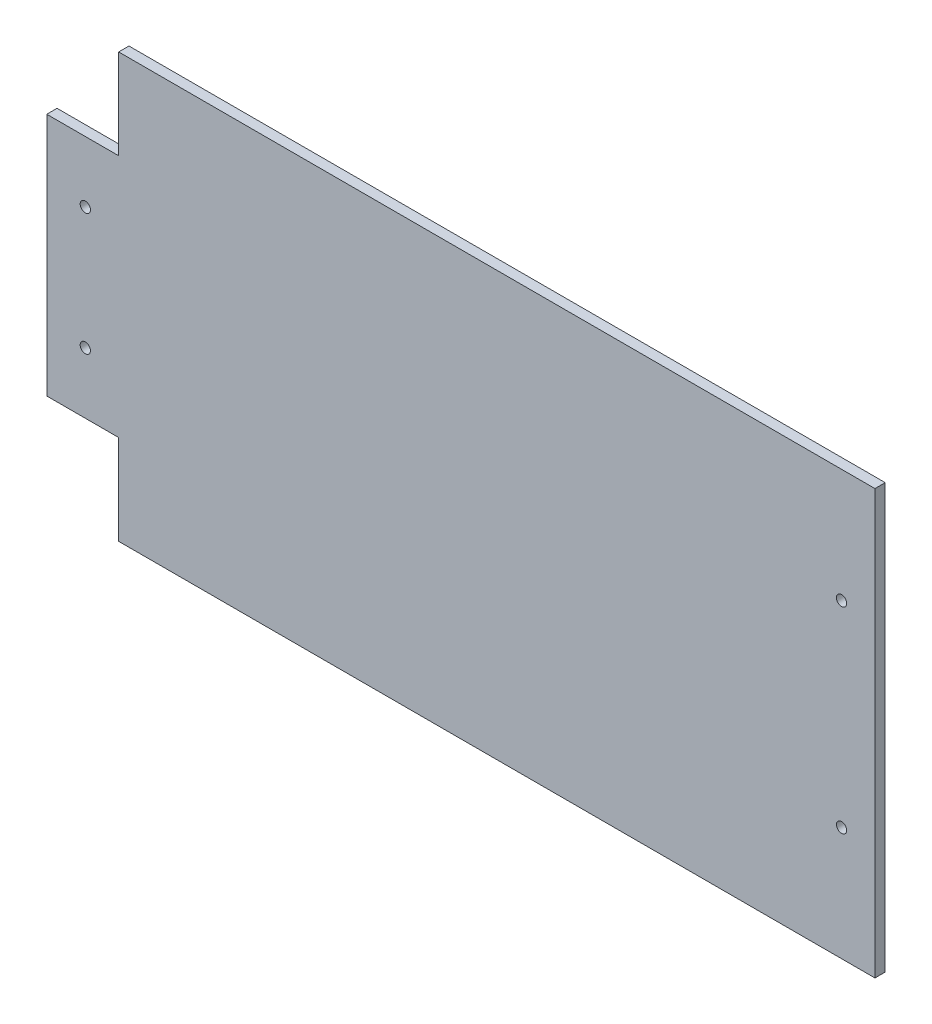
ISO-10303-21;
HEADER;
FILE_DESCRIPTION(('STEP AP214'),'2;1');
FILE_NAME('part.step','',(''),(''),'','','');
FILE_SCHEMA(('AUTOMOTIVE_DESIGN { 1 0 10303 214 1 1 1 1 }'));
ENDSEC;
DATA;
#1=APPLICATION_CONTEXT('core data for automotive mechanical design processes');
#2=APPLICATION_PROTOCOL_DEFINITION('international standard','automotive_design',2000,#1);
#3=PRODUCT_CONTEXT('',#1,'mechanical');
#4=PRODUCT('Part','Part','',(#3));
#5=PRODUCT_RELATED_PRODUCT_CATEGORY('part','',(#4));
#6=PRODUCT_DEFINITION_FORMATION('','',#4);
#7=PRODUCT_DEFINITION_CONTEXT('part definition',#1,'design');
#8=PRODUCT_DEFINITION('design','',#6,#7);
#9=PRODUCT_DEFINITION_SHAPE('','',#8);
#10=(LENGTH_UNIT() NAMED_UNIT(*) SI_UNIT(.MILLI.,.METRE.));
#11=(NAMED_UNIT(*) PLANE_ANGLE_UNIT() SI_UNIT($,.RADIAN.));
#12=(NAMED_UNIT(*) SI_UNIT($,.STERADIAN.) SOLID_ANGLE_UNIT());
#13=UNCERTAINTY_MEASURE_WITH_UNIT(LENGTH_MEASURE(1.E-05),#10,'distance_accuracy_value','');
#14=(GEOMETRIC_REPRESENTATION_CONTEXT(3) GLOBAL_UNCERTAINTY_ASSIGNED_CONTEXT((#13)) GLOBAL_UNIT_ASSIGNED_CONTEXT((#10,
#11,#12)) REPRESENTATION_CONTEXT('',''));
#15=CARTESIAN_POINT('',(0.,0.,0.));
#16=DIRECTION('',(0.,0.,1.));
#17=DIRECTION('',(1.,0.,0.));
#18=AXIS2_PLACEMENT_3D('',#15,#16,#17);
#19=CARTESIAN_POINT('',(0.,0.,4.));
#20=DIRECTION('',(0.,0.,-1.));
#21=DIRECTION('',(-1.,0.,0.));
#22=AXIS2_PLACEMENT_3D('',#19,#20,#21);
#23=PLANE('',#22);
#24=DIRECTION('',(0.,-1.,0.));
#25=VECTOR('',#24,1.);
#26=CARTESIAN_POINT('',(-196.100746736514,-36.390474580789,4.));
#27=LINE('',#26,#25);
#28=CARTESIAN_POINT('',(-196.100746736514,58.6095254381771,4.));
#29=VERTEX_POINT('',#28);
#30=CARTESIAN_POINT('',(-196.100746736514,-36.390474580789,4.));
#31=VERTEX_POINT('',#30);
#32=EDGE_CURVE('E170',#29,#31,#27,.T.);
#33=ORIENTED_EDGE('',*,*,#32,.T.);
#34=DIRECTION('',(1.,0.,0.));
#35=VECTOR('',#34,1.);
#36=CARTESIAN_POINT('',(-168.100746737764,-36.390474580789,4.));
#37=LINE('',#36,#35);
#38=CARTESIAN_POINT('',(-168.100746737764,-36.390474580789,4.));
#39=VERTEX_POINT('',#38);
#40=EDGE_CURVE('E106',#31,#39,#37,.T.);
#41=ORIENTED_EDGE('',*,*,#40,.T.);
#42=DIRECTION('',(0.,-1.,0.));
#43=VECTOR('',#42,1.);
#44=CARTESIAN_POINT('',(-168.100746737764,-71.3904746283267,4.));
#45=LINE('',#44,#43);
#46=CARTESIAN_POINT('',(-168.100746737764,-71.3904746283267,4.));
#47=VERTEX_POINT('',#46);
#48=EDGE_CURVE('E191',#39,#47,#45,.T.);
#49=ORIENTED_EDGE('',*,*,#48,.T.);
#50=DIRECTION('',(1.,0.,0.));
#51=VECTOR('',#50,1.);
#52=CARTESIAN_POINT('',(126.299253277226,-71.3904746283267,4.));
#53=LINE('',#52,#51);
#54=CARTESIAN_POINT('',(126.299253277226,-71.3904746283267,4.));
#55=VERTEX_POINT('',#54);
#56=EDGE_CURVE('E205',#47,#55,#53,.T.);
#57=ORIENTED_EDGE('',*,*,#56,.T.);
#58=DIRECTION('',(0.,1.,0.));
#59=VECTOR('',#58,1.);
#60=CARTESIAN_POINT('',(126.299253277226,93.6095256103751,4.));
#61=LINE('',#60,#59);
#62=CARTESIAN_POINT('',(126.299253277226,93.6095256103751,4.));
#63=VERTEX_POINT('',#62);
#64=EDGE_CURVE('E125',#55,#63,#61,.T.);
#65=ORIENTED_EDGE('',*,*,#64,.T.);
#66=DIRECTION('',(-1.,0.,0.));
#67=VECTOR('',#66,1.);
#68=CARTESIAN_POINT('',(-168.100746718209,93.6095256103751,4.));
#69=LINE('',#68,#67);
#70=CARTESIAN_POINT('',(-168.100746718209,93.6095256103751,4.));
#71=VERTEX_POINT('',#70);
#72=EDGE_CURVE('E119',#63,#71,#69,.T.);
#73=ORIENTED_EDGE('',*,*,#72,.T.);
#74=DIRECTION('',(0.,-1.,0.));
#75=VECTOR('',#74,1.);
#76=CARTESIAN_POINT('',(-168.100746718209,58.6095254381771,4.));
#77=LINE('',#76,#75);
#78=CARTESIAN_POINT('',(-168.100746718209,58.6095254381771,4.));
#79=VERTEX_POINT('',#78);
#80=EDGE_CURVE('E123',#71,#79,#77,.T.);
#81=ORIENTED_EDGE('',*,*,#80,.T.);
#82=DIRECTION('',(-1.,0.,0.));
#83=VECTOR('',#82,1.);
#84=CARTESIAN_POINT('',(-196.100746736514,58.6095254381771,4.));
#85=LINE('',#84,#83);
#86=EDGE_CURVE('E63',#79,#29,#85,.T.);
#87=ORIENTED_EDGE('',*,*,#86,.T.);
#88=EDGE_LOOP('',(#33,#41,#49,#57,#65,#73,#81,#87));
#89=FACE_BOUND('',#88,.T.);
#90=CARTESIAN_POINT('',(-181.100722248535,-12.6404744968072,4.));
#91=DIRECTION('',(0.,0.,1.));
#92=DIRECTION('',(1.,0.,0.));
#93=AXIS2_PLACEMENT_3D('',#90,#91,#92);
#94=CIRCLE('',#93,2.0000000000001);
#95=CARTESIAN_POINT('',(-179.100722248534,-12.6404744968072,4.));
#96=VERTEX_POINT('',#95);
#97=EDGE_CURVE('E152',#96,#96,#94,.T.);
#98=ORIENTED_EDGE('',*,*,#97,.F.);
#99=EDGE_LOOP('',(#98));
#100=FACE_BOUND('',#99,.T.);
#101=CARTESIAN_POINT('',(-181.100722248653,34.8595254567217,4.));
#102=DIRECTION('',(0.,0.,1.));
#103=DIRECTION('',(1.,0.,0.));
#104=AXIS2_PLACEMENT_3D('',#101,#102,#103);
#105=CIRCLE('',#104,2.0000000000001);
#106=CARTESIAN_POINT('',(-179.100722248653,34.8595254567217,4.));
#107=VERTEX_POINT('',#106);
#108=EDGE_CURVE('E219',#107,#107,#105,.T.);
#109=ORIENTED_EDGE('',*,*,#108,.F.);
#110=EDGE_LOOP('',(#109));
#111=FACE_BOUND('',#110,.T.);
#112=CARTESIAN_POINT('',(113.299277705841,49.3595254849248,4.));
#113=DIRECTION('',(0.,0.,1.));
#114=DIRECTION('',(1.,0.,0.));
#115=AXIS2_PLACEMENT_3D('',#112,#113,#114);
#116=CIRCLE('',#115,2.0000000000001);
#117=CARTESIAN_POINT('',(115.299277705841,49.3595254849248,4.));
#118=VERTEX_POINT('',#117);
#119=EDGE_CURVE('E227',#118,#118,#116,.T.);
#120=ORIENTED_EDGE('',*,*,#119,.F.);
#121=EDGE_LOOP('',(#120));
#122=FACE_BOUND('',#121,.T.);
#123=CARTESIAN_POINT('',(113.299277700855,-27.1404745152088,4.));
#124=DIRECTION('',(0.,0.,1.));
#125=DIRECTION('',(1.,0.,0.));
#126=AXIS2_PLACEMENT_3D('',#123,#124,#125);
#127=CIRCLE('',#126,2.0000000000001);
#128=CARTESIAN_POINT('',(115.299277700855,-27.1404745152088,4.));
#129=VERTEX_POINT('',#128);
#130=EDGE_CURVE('E235',#129,#129,#127,.T.);
#131=ORIENTED_EDGE('',*,*,#130,.F.);
#132=EDGE_LOOP('',(#131));
#133=FACE_BOUND('',#132,.T.);
#134=ADVANCED_FACE('F45',(#89,#100,#111,#122,#133),#23,.F.);
#135=CARTESIAN_POINT('',(0.,0.,0.));
#136=DIRECTION('',(0.,0.,-1.));
#137=DIRECTION('',(-1.,0.,0.));
#138=AXIS2_PLACEMENT_3D('',#135,#136,#137);
#139=PLANE('',#138);
#140=CARTESIAN_POINT('',(113.299277705841,49.3595254849248,0.));
#141=DIRECTION('',(0.,0.,1.));
#142=DIRECTION('',(1.,0.,0.));
#143=AXIS2_PLACEMENT_3D('',#140,#141,#142);
#144=CIRCLE('',#143,2.0000000000001);
#145=CARTESIAN_POINT('',(115.299277705841,49.3595254849248,0.));
#146=VERTEX_POINT('',#145);
#147=EDGE_CURVE('E231',#146,#146,#144,.T.);
#148=ORIENTED_EDGE('',*,*,#147,.T.);
#149=EDGE_LOOP('',(#148));
#150=FACE_BOUND('',#149,.T.);
#151=CARTESIAN_POINT('',(-181.100722248535,-12.6404744968072,0.));
#152=DIRECTION('',(0.,0.,1.));
#153=DIRECTION('',(1.,0.,0.));
#154=AXIS2_PLACEMENT_3D('',#151,#152,#153);
#155=CIRCLE('',#154,2.0000000000001);
#156=CARTESIAN_POINT('',(-179.100722248534,-12.6404744968072,0.));
#157=VERTEX_POINT('',#156);
#158=EDGE_CURVE('E215',#157,#157,#155,.T.);
#159=ORIENTED_EDGE('',*,*,#158,.T.);
#160=EDGE_LOOP('',(#159));
#161=FACE_BOUND('',#160,.T.);
#162=DIRECTION('',(0.,-1.,0.));
#163=VECTOR('',#162,1.);
#164=CARTESIAN_POINT('',(-196.100746736514,-36.390474580789,0.));
#165=LINE('',#164,#163);
#166=CARTESIAN_POINT('',(-196.100746736514,58.6095254381771,0.));
#167=VERTEX_POINT('',#166);
#168=CARTESIAN_POINT('',(-196.100746736514,-36.390474580789,0.));
#169=VERTEX_POINT('',#168);
#170=EDGE_CURVE('E147',#167,#169,#165,.T.);
#171=ORIENTED_EDGE('',*,*,#170,.F.);
#172=DIRECTION('',(-1.,0.,0.));
#173=VECTOR('',#172,1.);
#174=CARTESIAN_POINT('',(-196.100746736514,58.6095254381771,0.));
#175=LINE('',#174,#173);
#176=CARTESIAN_POINT('',(-168.100746718209,58.6095254381771,0.));
#177=VERTEX_POINT('',#176);
#178=EDGE_CURVE('E98',#177,#167,#175,.T.);
#179=ORIENTED_EDGE('',*,*,#178,.F.);
#180=DIRECTION('',(0.,-1.,0.));
#181=VECTOR('',#180,1.);
#182=CARTESIAN_POINT('',(-168.100746718209,58.6095254381771,0.));
#183=LINE('',#182,#181);
#184=CARTESIAN_POINT('',(-168.100746718209,93.6095256103751,0.));
#185=VERTEX_POINT('',#184);
#186=EDGE_CURVE('E92',#185,#177,#183,.T.);
#187=ORIENTED_EDGE('',*,*,#186,.F.);
#188=DIRECTION('',(-1.,0.,0.));
#189=VECTOR('',#188,1.);
#190=CARTESIAN_POINT('',(-168.100746718209,93.6095256103751,0.));
#191=LINE('',#190,#189);
#192=CARTESIAN_POINT('',(126.299253277226,93.6095256103751,0.));
#193=VERTEX_POINT('',#192);
#194=EDGE_CURVE('E134',#193,#185,#191,.T.);
#195=ORIENTED_EDGE('',*,*,#194,.F.);
#196=DIRECTION('',(0.,1.,0.));
#197=VECTOR('',#196,1.);
#198=CARTESIAN_POINT('',(126.299253277226,93.6095256103751,0.));
#199=LINE('',#198,#197);
#200=CARTESIAN_POINT('',(126.299253277226,-71.3904746283267,0.));
#201=VERTEX_POINT('',#200);
#202=EDGE_CURVE('E161',#201,#193,#199,.T.);
#203=ORIENTED_EDGE('',*,*,#202,.F.);
#204=DIRECTION('',(1.,0.,0.));
#205=VECTOR('',#204,1.);
#206=CARTESIAN_POINT('',(126.299253277226,-71.3904746283267,0.));
#207=LINE('',#206,#205);
#208=CARTESIAN_POINT('',(-168.100746737764,-71.3904746283267,0.));
#209=VERTEX_POINT('',#208);
#210=EDGE_CURVE('E158',#209,#201,#207,.T.);
#211=ORIENTED_EDGE('',*,*,#210,.F.);
#212=DIRECTION('',(0.,-1.,0.));
#213=VECTOR('',#212,1.);
#214=CARTESIAN_POINT('',(-168.100746737764,-71.3904746283267,0.));
#215=LINE('',#214,#213);
#216=CARTESIAN_POINT('',(-168.100746737764,-36.390474580789,0.));
#217=VERTEX_POINT('',#216);
#218=EDGE_CURVE('E155',#217,#209,#215,.T.);
#219=ORIENTED_EDGE('',*,*,#218,.F.);
#220=DIRECTION('',(1.,0.,0.));
#221=VECTOR('',#220,1.);
#222=CARTESIAN_POINT('',(-168.100746737764,-36.390474580789,0.));
#223=LINE('',#222,#221);
#224=EDGE_CURVE('E151',#169,#217,#223,.T.);
#225=ORIENTED_EDGE('',*,*,#224,.F.);
#226=EDGE_LOOP('',(#171,#179,#187,#195,#203,#211,#219,#225));
#227=FACE_BOUND('',#226,.T.);
#228=CARTESIAN_POINT('',(-181.100722248653,34.8595254567217,0.));
#229=DIRECTION('',(0.,0.,1.));
#230=DIRECTION('',(1.,0.,0.));
#231=AXIS2_PLACEMENT_3D('',#228,#229,#230);
#232=CIRCLE('',#231,2.0000000000001);
#233=CARTESIAN_POINT('',(-179.100722248653,34.8595254567217,0.));
#234=VERTEX_POINT('',#233);
#235=EDGE_CURVE('E223',#234,#234,#232,.T.);
#236=ORIENTED_EDGE('',*,*,#235,.T.);
#237=EDGE_LOOP('',(#236));
#238=FACE_BOUND('',#237,.T.);
#239=CARTESIAN_POINT('',(113.299277700855,-27.1404745152088,0.));
#240=DIRECTION('',(0.,0.,1.));
#241=DIRECTION('',(1.,0.,0.));
#242=AXIS2_PLACEMENT_3D('',#239,#240,#241);
#243=CIRCLE('',#242,2.0000000000001);
#244=CARTESIAN_POINT('',(115.299277700855,-27.1404745152088,0.));
#245=VERTEX_POINT('',#244);
#246=EDGE_CURVE('E239',#245,#245,#243,.T.);
#247=ORIENTED_EDGE('',*,*,#246,.T.);
#248=EDGE_LOOP('',(#247));
#249=FACE_BOUND('',#248,.T.);
#250=ADVANCED_FACE('F195',(#150,#161,#227,#238,#249),#139,.T.);
#251=CARTESIAN_POINT('',(-196.100746736514,-36.390474580789,4.));
#252=DIRECTION('',(1.,0.,0.));
#253=DIRECTION('',(0.,0.,-1.));
#254=AXIS2_PLACEMENT_3D('',#251,#252,#253);
#255=PLANE('',#254);
#256=ORIENTED_EDGE('',*,*,#170,.T.);
#257=DIRECTION('',(0.,0.,-1.));
#258=VECTOR('',#257,1.);
#259=CARTESIAN_POINT('',(-196.100746736514,-36.390474580789,4.));
#260=LINE('',#259,#258);
#261=EDGE_CURVE('E11',#31,#169,#260,.T.);
#262=ORIENTED_EDGE('',*,*,#261,.F.);
#263=ORIENTED_EDGE('',*,*,#32,.F.);
#264=DIRECTION('',(0.,0.,-1.));
#265=VECTOR('',#264,1.);
#266=CARTESIAN_POINT('',(-196.100746736514,58.6095254381771,4.));
#267=LINE('',#266,#265);
#268=EDGE_CURVE('E143',#29,#167,#267,.T.);
#269=ORIENTED_EDGE('',*,*,#268,.T.);
#270=EDGE_LOOP('',(#256,#262,#263,#269));
#271=FACE_BOUND('',#270,.T.);
#272=ADVANCED_FACE('F47',(#271),#255,.F.);
#273=CARTESIAN_POINT('',(-168.100746737764,-36.390474580789,4.));
#274=DIRECTION('',(0.,1.,0.));
#275=DIRECTION('',(0.,0.,1.));
#276=AXIS2_PLACEMENT_3D('',#273,#274,#275);
#277=PLANE('',#276);
#278=ORIENTED_EDGE('',*,*,#224,.T.);
#279=DIRECTION('',(0.,0.,-1.));
#280=VECTOR('',#279,1.);
#281=CARTESIAN_POINT('',(-168.100746737764,-36.390474580789,4.));
#282=LINE('',#281,#280);
#283=EDGE_CURVE('E55',#39,#217,#282,.T.);
#284=ORIENTED_EDGE('',*,*,#283,.F.);
#285=ORIENTED_EDGE('',*,*,#40,.F.);
#286=ORIENTED_EDGE('',*,*,#261,.T.);
#287=EDGE_LOOP('',(#278,#284,#285,#286));
#288=FACE_BOUND('',#287,.T.);
#289=ADVANCED_FACE('F273',(#288),#277,.F.);
#290=CARTESIAN_POINT('',(-168.100746737764,-71.3904746283267,4.));
#291=DIRECTION('',(1.,0.,0.));
#292=DIRECTION('',(0.,0.,-1.));
#293=AXIS2_PLACEMENT_3D('',#290,#291,#292);
#294=PLANE('',#293);
#295=ORIENTED_EDGE('',*,*,#218,.T.);
#296=DIRECTION('',(0.,0.,-1.));
#297=VECTOR('',#296,1.);
#298=CARTESIAN_POINT('',(-168.100746737764,-71.3904746283267,4.));
#299=LINE('',#298,#297);
#300=EDGE_CURVE('E181',#47,#209,#299,.T.);
#301=ORIENTED_EDGE('',*,*,#300,.F.);
#302=ORIENTED_EDGE('',*,*,#48,.F.);
#303=ORIENTED_EDGE('',*,*,#283,.T.);
#304=EDGE_LOOP('',(#295,#301,#302,#303));
#305=FACE_BOUND('',#304,.T.);
#306=ADVANCED_FACE('F189',(#305),#294,.F.);
#307=CARTESIAN_POINT('',(126.299253277226,-71.3904746283267,4.));
#308=DIRECTION('',(0.,1.,0.));
#309=DIRECTION('',(0.,0.,1.));
#310=AXIS2_PLACEMENT_3D('',#307,#308,#309);
#311=PLANE('',#310);
#312=ORIENTED_EDGE('',*,*,#210,.T.);
#313=DIRECTION('',(0.,0.,-1.));
#314=VECTOR('',#313,1.);
#315=CARTESIAN_POINT('',(126.299253277226,-71.3904746283267,4.));
#316=LINE('',#315,#314);
#317=EDGE_CURVE('E177',#55,#201,#316,.T.);
#318=ORIENTED_EDGE('',*,*,#317,.F.);
#319=ORIENTED_EDGE('',*,*,#56,.F.);
#320=ORIENTED_EDGE('',*,*,#300,.T.);
#321=EDGE_LOOP('',(#312,#318,#319,#320));
#322=FACE_BOUND('',#321,.T.);
#323=ADVANCED_FACE('F200',(#322),#311,.F.);
#324=CARTESIAN_POINT('',(126.299253277226,93.6095256103751,4.));
#325=DIRECTION('',(-1.,0.,0.));
#326=DIRECTION('',(0.,0.,1.));
#327=AXIS2_PLACEMENT_3D('',#324,#325,#326);
#328=PLANE('',#327);
#329=ORIENTED_EDGE('',*,*,#202,.T.);
#330=DIRECTION('',(0.,0.,-1.));
#331=VECTOR('',#330,1.);
#332=CARTESIAN_POINT('',(126.299253277226,93.6095256103751,4.));
#333=LINE('',#332,#331);
#334=EDGE_CURVE('E136',#63,#193,#333,.T.);
#335=ORIENTED_EDGE('',*,*,#334,.F.);
#336=ORIENTED_EDGE('',*,*,#64,.F.);
#337=ORIENTED_EDGE('',*,*,#317,.T.);
#338=EDGE_LOOP('',(#329,#335,#336,#337));
#339=FACE_BOUND('',#338,.T.);
#340=ADVANCED_FACE('F203',(#339),#328,.F.);
#341=CARTESIAN_POINT('',(-168.100746718209,93.6095256103751,4.));
#342=DIRECTION('',(0.,-1.,0.));
#343=DIRECTION('',(0.,0.,-1.));
#344=AXIS2_PLACEMENT_3D('',#341,#342,#343);
#345=PLANE('',#344);
#346=ORIENTED_EDGE('',*,*,#194,.T.);
#347=DIRECTION('',(0.,0.,-1.));
#348=VECTOR('',#347,1.);
#349=CARTESIAN_POINT('',(-168.100746718209,93.6095256103751,4.));
#350=LINE('',#349,#348);
#351=EDGE_CURVE('E131',#71,#185,#350,.T.);
#352=ORIENTED_EDGE('',*,*,#351,.F.);
#353=ORIENTED_EDGE('',*,*,#72,.F.);
#354=ORIENTED_EDGE('',*,*,#334,.T.);
#355=EDGE_LOOP('',(#346,#352,#353,#354));
#356=FACE_BOUND('',#355,.T.);
#357=ADVANCED_FACE('F132',(#356),#345,.F.);
#358=CARTESIAN_POINT('',(-168.100746718209,58.6095254381771,4.));
#359=DIRECTION('',(1.,0.,0.));
#360=DIRECTION('',(0.,0.,-1.));
#361=AXIS2_PLACEMENT_3D('',#358,#359,#360);
#362=PLANE('',#361);
#363=ORIENTED_EDGE('',*,*,#186,.T.);
#364=DIRECTION('',(0.,0.,-1.));
#365=VECTOR('',#364,1.);
#366=CARTESIAN_POINT('',(-168.100746718209,58.6095254381771,4.));
#367=LINE('',#366,#365);
#368=EDGE_CURVE('E137',#79,#177,#367,.T.);
#369=ORIENTED_EDGE('',*,*,#368,.F.);
#370=ORIENTED_EDGE('',*,*,#80,.F.);
#371=ORIENTED_EDGE('',*,*,#351,.T.);
#372=EDGE_LOOP('',(#363,#369,#370,#371));
#373=FACE_BOUND('',#372,.T.);
#374=ADVANCED_FACE('F139',(#373),#362,.F.);
#375=CARTESIAN_POINT('',(-196.100746736514,58.6095254381771,4.));
#376=DIRECTION('',(0.,-1.,0.));
#377=DIRECTION('',(0.,0.,-1.));
#378=AXIS2_PLACEMENT_3D('',#375,#376,#377);
#379=PLANE('',#378);
#380=ORIENTED_EDGE('',*,*,#178,.T.);
#381=ORIENTED_EDGE('',*,*,#268,.F.);
#382=ORIENTED_EDGE('',*,*,#86,.F.);
#383=ORIENTED_EDGE('',*,*,#368,.T.);
#384=EDGE_LOOP('',(#380,#381,#382,#383));
#385=FACE_BOUND('',#384,.T.);
#386=ADVANCED_FACE('F261',(#385),#379,.F.);
#387=CARTESIAN_POINT('',(-181.100722248535,-12.6404744968072,4.));
#388=DIRECTION('',(0.,0.,-1.));
#389=DIRECTION('',(-1.,0.,0.));
#390=AXIS2_PLACEMENT_3D('',#387,#388,#389);
#391=CYLINDRICAL_SURFACE('',#390,2.0000000000001);
#392=ORIENTED_EDGE('',*,*,#97,.T.);
#393=EDGE_LOOP('',(#392));
#394=FACE_BOUND('',#393,.T.);
#395=ORIENTED_EDGE('',*,*,#158,.F.);
#396=EDGE_LOOP('',(#395));
#397=FACE_BOUND('',#396,.T.);
#398=ADVANCED_FACE('F258',(#394,#397),#391,.F.);
#399=CARTESIAN_POINT('',(-181.100722248653,34.8595254567217,4.));
#400=DIRECTION('',(0.,0.,-1.));
#401=DIRECTION('',(-1.,0.,0.));
#402=AXIS2_PLACEMENT_3D('',#399,#400,#401);
#403=CYLINDRICAL_SURFACE('',#402,2.0000000000001);
#404=ORIENTED_EDGE('',*,*,#108,.T.);
#405=EDGE_LOOP('',(#404));
#406=FACE_BOUND('',#405,.T.);
#407=ORIENTED_EDGE('',*,*,#235,.F.);
#408=EDGE_LOOP('',(#407));
#409=FACE_BOUND('',#408,.T.);
#410=ADVANCED_FACE('F336',(#406,#409),#403,.F.);
#411=CARTESIAN_POINT('',(113.299277705841,49.3595254849248,4.));
#412=DIRECTION('',(0.,0.,-1.));
#413=DIRECTION('',(-1.,0.,0.));
#414=AXIS2_PLACEMENT_3D('',#411,#412,#413);
#415=CYLINDRICAL_SURFACE('',#414,2.0000000000001);
#416=ORIENTED_EDGE('',*,*,#119,.T.);
#417=EDGE_LOOP('',(#416));
#418=FACE_BOUND('',#417,.T.);
#419=ORIENTED_EDGE('',*,*,#147,.F.);
#420=EDGE_LOOP('',(#419));
#421=FACE_BOUND('',#420,.T.);
#422=ADVANCED_FACE('F344',(#418,#421),#415,.F.);
#423=CARTESIAN_POINT('',(113.299277700855,-27.1404745152088,4.));
#424=DIRECTION('',(0.,0.,-1.));
#425=DIRECTION('',(-1.,0.,0.));
#426=AXIS2_PLACEMENT_3D('',#423,#424,#425);
#427=CYLINDRICAL_SURFACE('',#426,2.0000000000001);
#428=ORIENTED_EDGE('',*,*,#130,.T.);
#429=EDGE_LOOP('',(#428));
#430=FACE_BOUND('',#429,.T.);
#431=ORIENTED_EDGE('',*,*,#246,.F.);
#432=EDGE_LOOP('',(#431));
#433=FACE_BOUND('',#432,.T.);
#434=ADVANCED_FACE('F247',(#430,#433),#427,.F.);
#435=CLOSED_SHELL('',(#134,#250,#272,#289,#306,#323,#340,#357,#374,#386,#398,#410,#422,#434));
#436=MANIFOLD_SOLID_BREP('B2',#435);
#437=ADVANCED_BREP_SHAPE_REPRESENTATION('',(#18,#436),#14);
#438=SHAPE_DEFINITION_REPRESENTATION(#9,#437);
ENDSEC;
END-ISO-10303-21;
